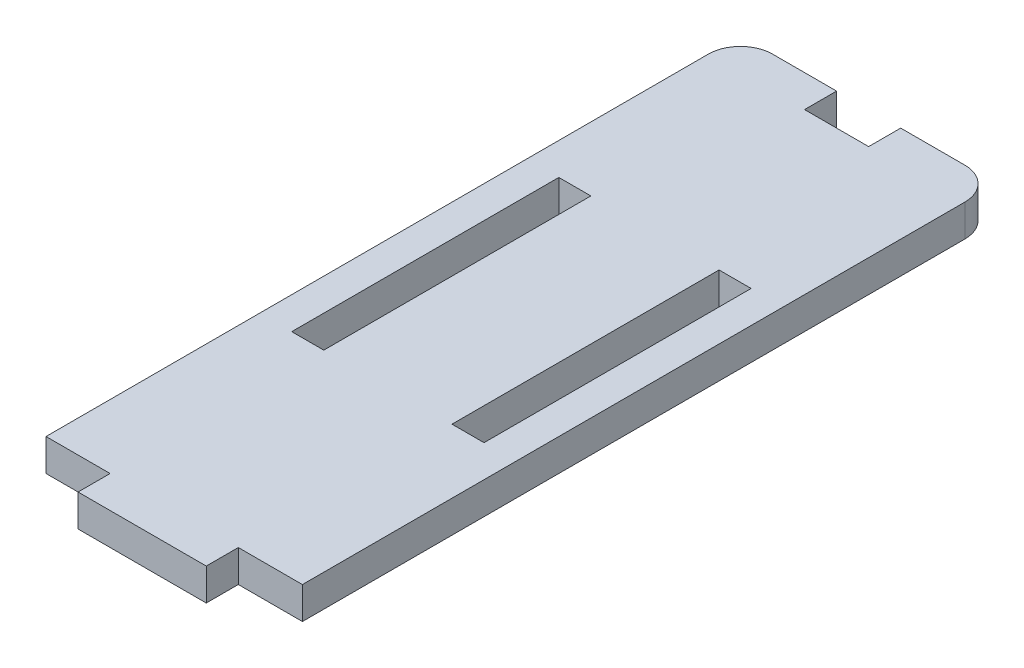
ISO-10303-21;
HEADER;
FILE_DESCRIPTION(('STEP AP214'),'2;1');
FILE_NAME('part.step','',(''),(''),'','','');
FILE_SCHEMA(('AUTOMOTIVE_DESIGN { 1 0 10303 214 1 1 1 1 }'));
ENDSEC;
DATA;
#1=APPLICATION_CONTEXT('core data for automotive mechanical design processes');
#2=APPLICATION_PROTOCOL_DEFINITION('international standard','automotive_design',2000,#1);
#3=PRODUCT_CONTEXT('',#1,'mechanical');
#4=PRODUCT('Part','Part','',(#3));
#5=PRODUCT_RELATED_PRODUCT_CATEGORY('part','',(#4));
#6=PRODUCT_DEFINITION_FORMATION('','',#4);
#7=PRODUCT_DEFINITION_CONTEXT('part definition',#1,'design');
#8=PRODUCT_DEFINITION('design','',#6,#7);
#9=PRODUCT_DEFINITION_SHAPE('','',#8);
#10=(LENGTH_UNIT() NAMED_UNIT(*) SI_UNIT(.MILLI.,.METRE.));
#11=(NAMED_UNIT(*) PLANE_ANGLE_UNIT() SI_UNIT($,.RADIAN.));
#12=(NAMED_UNIT(*) SI_UNIT($,.STERADIAN.) SOLID_ANGLE_UNIT());
#13=UNCERTAINTY_MEASURE_WITH_UNIT(LENGTH_MEASURE(1.E-05),#10,'distance_accuracy_value','');
#14=(GEOMETRIC_REPRESENTATION_CONTEXT(3) GLOBAL_UNCERTAINTY_ASSIGNED_CONTEXT((#13)) GLOBAL_UNIT_ASSIGNED_CONTEXT((#10,
#11,#12)) REPRESENTATION_CONTEXT('',''));
#15=CARTESIAN_POINT('',(0.,0.,0.));
#16=DIRECTION('',(0.,0.,1.));
#17=DIRECTION('',(1.,0.,0.));
#18=AXIS2_PLACEMENT_3D('',#15,#16,#17);
#19=CARTESIAN_POINT('',(-12.,1.5,-32.5));
#20=DIRECTION('',(0.,0.,1.));
#21=DIRECTION('',(1.,0.,0.));
#22=AXIS2_PLACEMENT_3D('',#19,#20,#21);
#23=PLANE('',#22);
#24=DIRECTION('',(-1.,0.,0.));
#25=VECTOR('',#24,1.);
#26=CARTESIAN_POINT('',(-12.,1.5,-32.5));
#27=LINE('',#26,#25);
#28=CARTESIAN_POINT('',(-3.,1.5,-32.5));
#29=VERTEX_POINT('',#28);
#30=CARTESIAN_POINT('',(-9.,1.5,-32.5));
#31=VERTEX_POINT('',#30);
#32=EDGE_CURVE('E321',#29,#31,#27,.T.);
#33=ORIENTED_EDGE('',*,*,#32,.F.);
#34=DIRECTION('',(0.,1.,0.));
#35=VECTOR('',#34,1.);
#36=CARTESIAN_POINT('',(-3.,-1.5,-32.5));
#37=LINE('',#36,#35);
#38=CARTESIAN_POINT('',(-3.,-1.5,-32.5));
#39=VERTEX_POINT('',#38);
#40=EDGE_CURVE('E202',#39,#29,#37,.T.);
#41=ORIENTED_EDGE('',*,*,#40,.F.);
#42=DIRECTION('',(-1.,0.,0.));
#43=VECTOR('',#42,1.);
#44=CARTESIAN_POINT('',(-12.,-1.5,-32.5));
#45=LINE('',#44,#43);
#46=CARTESIAN_POINT('',(-9.,-1.5,-32.5));
#47=VERTEX_POINT('',#46);
#48=EDGE_CURVE('E333',#39,#47,#45,.T.);
#49=ORIENTED_EDGE('',*,*,#48,.T.);
#50=DIRECTION('',(0.,-1.,0.));
#51=VECTOR('',#50,1.);
#52=CARTESIAN_POINT('',(-9.,1.5,-32.5));
#53=LINE('',#52,#51);
#54=EDGE_CURVE('E341',#47,#31,#53,.F.);
#55=ORIENTED_EDGE('',*,*,#54,.T.);
#56=EDGE_LOOP('',(#33,#41,#49,#55));
#57=FACE_BOUND('',#56,.T.);
#58=ADVANCED_FACE('F37',(#57),#23,.F.);
#59=CARTESIAN_POINT('',(-12.,1.5,32.5));
#60=DIRECTION('',(0.,0.,-1.));
#61=DIRECTION('',(-1.,0.,0.));
#62=AXIS2_PLACEMENT_3D('',#59,#60,#61);
#63=PLANE('',#62);
#64=DIRECTION('',(0.,-1.,0.));
#65=VECTOR('',#64,1.);
#66=CARTESIAN_POINT('',(-6.00000000000003,1.5,32.5));
#67=LINE('',#66,#65);
#68=CARTESIAN_POINT('',(-6.00000000000003,1.5,32.5));
#69=VERTEX_POINT('',#68);
#70=CARTESIAN_POINT('',(-6.00000000000003,-1.5,32.5));
#71=VERTEX_POINT('',#70);
#72=EDGE_CURVE('E294',#69,#71,#67,.T.);
#73=ORIENTED_EDGE('',*,*,#72,.F.);
#74=DIRECTION('',(1.,0.,0.));
#75=VECTOR('',#74,1.);
#76=CARTESIAN_POINT('',(-12.,1.5,32.5));
#77=LINE('',#76,#75);
#78=CARTESIAN_POINT('',(-12.,1.5,32.5));
#79=VERTEX_POINT('',#78);
#80=EDGE_CURVE('E315',#79,#69,#77,.T.);
#81=ORIENTED_EDGE('',*,*,#80,.F.);
#82=DIRECTION('',(0.,-1.,0.));
#83=VECTOR('',#82,1.);
#84=CARTESIAN_POINT('',(-12.,1.5,32.5));
#85=LINE('',#84,#83);
#86=CARTESIAN_POINT('',(-12.,-1.5,32.5));
#87=VERTEX_POINT('',#86);
#88=EDGE_CURVE('E338',#79,#87,#85,.T.);
#89=ORIENTED_EDGE('',*,*,#88,.T.);
#90=DIRECTION('',(1.,0.,0.));
#91=VECTOR('',#90,1.);
#92=CARTESIAN_POINT('',(-12.,-1.5,32.5));
#93=LINE('',#92,#91);
#94=EDGE_CURVE('E327',#87,#71,#93,.T.);
#95=ORIENTED_EDGE('',*,*,#94,.T.);
#96=EDGE_LOOP('',(#73,#81,#89,#95));
#97=FACE_BOUND('',#96,.T.);
#98=ADVANCED_FACE('F392',(#97),#63,.F.);
#99=CARTESIAN_POINT('',(-12.,1.5,-32.5));
#100=DIRECTION('',(1.,0.,0.));
#101=DIRECTION('',(0.,0.,-1.));
#102=AXIS2_PLACEMENT_3D('',#99,#100,#101);
#103=PLANE('',#102);
#104=DIRECTION('',(0.,0.,1.));
#105=VECTOR('',#104,1.);
#106=CARTESIAN_POINT('',(-12.,1.5,-32.5));
#107=LINE('',#106,#105);
#108=CARTESIAN_POINT('',(-12.,1.5,-29.5));
#109=VERTEX_POINT('',#108);
#110=EDGE_CURVE('E311',#109,#79,#107,.T.);
#111=ORIENTED_EDGE('',*,*,#110,.F.);
#112=DIRECTION('',(0.,-1.,0.));
#113=VECTOR('',#112,1.);
#114=CARTESIAN_POINT('',(-12.,1.5,-29.5));
#115=LINE('',#114,#113);
#116=CARTESIAN_POINT('',(-12.,-1.5,-29.5));
#117=VERTEX_POINT('',#116);
#118=EDGE_CURVE('E11',#109,#117,#115,.T.);
#119=ORIENTED_EDGE('',*,*,#118,.T.);
#120=DIRECTION('',(0.,0.,1.));
#121=VECTOR('',#120,1.);
#122=CARTESIAN_POINT('',(-12.,-1.5,-32.5));
#123=LINE('',#122,#121);
#124=EDGE_CURVE('E310',#117,#87,#123,.T.);
#125=ORIENTED_EDGE('',*,*,#124,.T.);
#126=ORIENTED_EDGE('',*,*,#88,.F.);
#127=EDGE_LOOP('',(#111,#119,#125,#126));
#128=FACE_BOUND('',#127,.T.);
#129=ADVANCED_FACE('F396',(#128),#103,.F.);
#130=CARTESIAN_POINT('',(6.00000000000003,1.5,32.5));
#131=VERTEX_POINT('',#130);
#132=CARTESIAN_POINT('',(12.,1.5,32.5));
#133=VERTEX_POINT('',#132);
#134=EDGE_CURVE('E313',#131,#133,#77,.T.);
#135=ORIENTED_EDGE('',*,*,#134,.F.);
#136=DIRECTION('',(0.,-1.,0.));
#137=VECTOR('',#136,1.);
#138=CARTESIAN_POINT('',(6.00000000000003,1.5,32.5));
#139=LINE('',#138,#137);
#140=CARTESIAN_POINT('',(6.00000000000003,-1.5,32.5));
#141=VERTEX_POINT('',#140);
#142=EDGE_CURVE('E301',#131,#141,#139,.T.);
#143=ORIENTED_EDGE('',*,*,#142,.T.);
#144=CARTESIAN_POINT('',(12.,-1.5,32.5));
#145=VERTEX_POINT('',#144);
#146=EDGE_CURVE('E326',#141,#145,#93,.T.);
#147=ORIENTED_EDGE('',*,*,#146,.T.);
#148=DIRECTION('',(0.,-1.,0.));
#149=VECTOR('',#148,1.);
#150=CARTESIAN_POINT('',(12.,1.5,32.5));
#151=LINE('',#150,#149);
#152=EDGE_CURVE('E324',#133,#145,#151,.T.);
#153=ORIENTED_EDGE('',*,*,#152,.F.);
#154=EDGE_LOOP('',(#135,#143,#147,#153));
#155=FACE_BOUND('',#154,.T.);
#156=ADVANCED_FACE('F375',(#155),#63,.F.);
#157=CARTESIAN_POINT('',(12.,1.5,-32.5));
#158=DIRECTION('',(-1.,0.,0.));
#159=DIRECTION('',(0.,0.,1.));
#160=AXIS2_PLACEMENT_3D('',#157,#158,#159);
#161=PLANE('',#160);
#162=DIRECTION('',(0.,0.,-1.));
#163=VECTOR('',#162,1.);
#164=CARTESIAN_POINT('',(12.,-1.5,-32.5));
#165=LINE('',#164,#163);
#166=CARTESIAN_POINT('',(12.,-1.5,-29.5));
#167=VERTEX_POINT('',#166);
#168=EDGE_CURVE('E330',#145,#167,#165,.T.);
#169=ORIENTED_EDGE('',*,*,#168,.T.);
#170=DIRECTION('',(0.,-1.,0.));
#171=VECTOR('',#170,1.);
#172=CARTESIAN_POINT('',(12.,1.5,-29.5));
#173=LINE('',#172,#171);
#174=CARTESIAN_POINT('',(12.,1.5,-29.5));
#175=VERTEX_POINT('',#174);
#176=EDGE_CURVE('E352',#167,#175,#173,.F.);
#177=ORIENTED_EDGE('',*,*,#176,.T.);
#178=DIRECTION('',(0.,0.,-1.));
#179=VECTOR('',#178,1.);
#180=CARTESIAN_POINT('',(12.,1.5,-32.5));
#181=LINE('',#180,#179);
#182=EDGE_CURVE('E318',#133,#175,#181,.T.);
#183=ORIENTED_EDGE('',*,*,#182,.F.);
#184=ORIENTED_EDGE('',*,*,#152,.T.);
#185=EDGE_LOOP('',(#169,#177,#183,#184));
#186=FACE_BOUND('',#185,.T.);
#187=ADVANCED_FACE('F371',(#186),#161,.F.);
#188=CARTESIAN_POINT('',(9.,-1.5,-32.5));
#189=VERTEX_POINT('',#188);
#190=CARTESIAN_POINT('',(3.,-1.5,-32.5));
#191=VERTEX_POINT('',#190);
#192=EDGE_CURVE('E314',#189,#191,#45,.T.);
#193=ORIENTED_EDGE('',*,*,#192,.T.);
#194=DIRECTION('',(0.,1.,0.));
#195=VECTOR('',#194,1.);
#196=CARTESIAN_POINT('',(3.,-1.5,-32.5));
#197=LINE('',#196,#195);
#198=CARTESIAN_POINT('',(3.,1.5,-32.5));
#199=VERTEX_POINT('',#198);
#200=EDGE_CURVE('E218',#191,#199,#197,.T.);
#201=ORIENTED_EDGE('',*,*,#200,.T.);
#202=CARTESIAN_POINT('',(9.,1.5,-32.5));
#203=VERTEX_POINT('',#202);
#204=EDGE_CURVE('E322',#203,#199,#27,.T.);
#205=ORIENTED_EDGE('',*,*,#204,.F.);
#206=DIRECTION('',(0.,-1.,0.));
#207=VECTOR('',#206,1.);
#208=CARTESIAN_POINT('',(9.,1.5,-32.5));
#209=LINE('',#208,#207);
#210=EDGE_CURVE('E344',#203,#189,#209,.T.);
#211=ORIENTED_EDGE('',*,*,#210,.T.);
#212=EDGE_LOOP('',(#193,#201,#205,#211));
#213=FACE_BOUND('',#212,.T.);
#214=ADVANCED_FACE('F361',(#213),#23,.F.);
#215=CARTESIAN_POINT('',(0.,1.5,0.));
#216=DIRECTION('',(0.,1.,0.));
#217=DIRECTION('',(0.,0.,1.));
#218=AXIS2_PLACEMENT_3D('',#215,#216,#217);
#219=PLANE('',#218);
#220=DIRECTION('',(0.,0.,1.));
#221=VECTOR('',#220,1.);
#222=CARTESIAN_POINT('',(-3.,1.5,-32.5));
#223=LINE('',#222,#221);
#224=CARTESIAN_POINT('',(-3.,1.5,-29.5));
#225=VERTEX_POINT('',#224);
#226=EDGE_CURVE('E199',#29,#225,#223,.T.);
#227=ORIENTED_EDGE('',*,*,#226,.F.);
#228=ORIENTED_EDGE('',*,*,#32,.T.);
#229=CARTESIAN_POINT('',(-9.,1.5,-29.5));
#230=DIRECTION('',(0.,1.,0.));
#231=DIRECTION('',(0.,0.,1.));
#232=AXIS2_PLACEMENT_3D('',#229,#230,#231);
#233=CIRCLE('',#232,3.);
#234=EDGE_CURVE('E60',#31,#109,#233,.T.);
#235=ORIENTED_EDGE('',*,*,#234,.T.);
#236=ORIENTED_EDGE('',*,*,#110,.T.);
#237=ORIENTED_EDGE('',*,*,#80,.T.);
#238=DIRECTION('',(0.,0.,1.));
#239=VECTOR('',#238,1.);
#240=CARTESIAN_POINT('',(-6.00000000000003,1.5,32.5));
#241=LINE('',#240,#239);
#242=CARTESIAN_POINT('',(-6.00000000000003,1.5,35.5));
#243=VERTEX_POINT('',#242);
#244=EDGE_CURVE('E286',#69,#243,#241,.T.);
#245=ORIENTED_EDGE('',*,*,#244,.T.);
#246=DIRECTION('',(1.,0.,0.));
#247=VECTOR('',#246,1.);
#248=CARTESIAN_POINT('',(-6.00000000000003,1.5,35.5));
#249=LINE('',#248,#247);
#250=CARTESIAN_POINT('',(5.99999999999997,1.5,35.5));
#251=VERTEX_POINT('',#250);
#252=EDGE_CURVE('E289',#243,#251,#249,.T.);
#253=ORIENTED_EDGE('',*,*,#252,.T.);
#254=DIRECTION('',(0.,0.,-1.));
#255=VECTOR('',#254,1.);
#256=CARTESIAN_POINT('',(6.00000000000003,1.5,32.5));
#257=LINE('',#256,#255);
#258=EDGE_CURVE('E292',#251,#131,#257,.T.);
#259=ORIENTED_EDGE('',*,*,#258,.T.);
#260=ORIENTED_EDGE('',*,*,#134,.T.);
#261=ORIENTED_EDGE('',*,*,#182,.T.);
#262=CARTESIAN_POINT('',(9.,1.5,-29.5));
#263=DIRECTION('',(0.,1.,0.));
#264=DIRECTION('',(0.,0.,1.));
#265=AXIS2_PLACEMENT_3D('',#262,#263,#264);
#266=CIRCLE('',#265,3.);
#267=EDGE_CURVE('E45',#175,#203,#266,.T.);
#268=ORIENTED_EDGE('',*,*,#267,.T.);
#269=ORIENTED_EDGE('',*,*,#204,.T.);
#270=DIRECTION('',(0.,0.,-1.));
#271=VECTOR('',#270,1.);
#272=CARTESIAN_POINT('',(3.,1.5,-32.5));
#273=LINE('',#272,#271);
#274=CARTESIAN_POINT('',(3.,1.5,-29.5));
#275=VERTEX_POINT('',#274);
#276=EDGE_CURVE('E208',#275,#199,#273,.T.);
#277=ORIENTED_EDGE('',*,*,#276,.F.);
#278=DIRECTION('',(1.,0.,0.));
#279=VECTOR('',#278,1.);
#280=CARTESIAN_POINT('',(-3.,1.5,-29.5));
#281=LINE('',#280,#279);
#282=EDGE_CURVE('E190',#225,#275,#281,.T.);
#283=ORIENTED_EDGE('',*,*,#282,.F.);
#284=EDGE_LOOP('',(#227,#228,#235,#236,#237,#245,#253,#259,#260,#261,#268,#269,#277,#283));
#285=FACE_BOUND('',#284,.T.);
#286=DIRECTION('',(0.,0.,1.));
#287=VECTOR('',#286,1.);
#288=CARTESIAN_POINT('',(-8.99999999999999,1.5,-12.5));
#289=LINE('',#288,#287);
#290=CARTESIAN_POINT('',(-8.99999999999999,1.5,-12.5));
#291=VERTEX_POINT('',#290);
#292=CARTESIAN_POINT('',(-8.99999999999999,1.5,12.5));
#293=VERTEX_POINT('',#292);
#294=EDGE_CURVE('E222',#291,#293,#289,.T.);
#295=ORIENTED_EDGE('',*,*,#294,.F.);
#296=DIRECTION('',(-1.,0.,0.));
#297=VECTOR('',#296,1.);
#298=CARTESIAN_POINT('',(-8.99999999999999,1.5,-12.5));
#299=LINE('',#298,#297);
#300=CARTESIAN_POINT('',(-5.99999999999999,1.5,-12.5));
#301=VERTEX_POINT('',#300);
#302=EDGE_CURVE('E231',#301,#291,#299,.T.);
#303=ORIENTED_EDGE('',*,*,#302,.F.);
#304=DIRECTION('',(0.,0.,-1.));
#305=VECTOR('',#304,1.);
#306=CARTESIAN_POINT('',(-5.99999999999999,1.5,-12.5));
#307=LINE('',#306,#305);
#308=CARTESIAN_POINT('',(-5.99999999999999,1.5,12.5));
#309=VERTEX_POINT('',#308);
#310=EDGE_CURVE('E228',#309,#301,#307,.T.);
#311=ORIENTED_EDGE('',*,*,#310,.F.);
#312=DIRECTION('',(1.,0.,0.));
#313=VECTOR('',#312,1.);
#314=CARTESIAN_POINT('',(-8.99999999999999,1.5,12.5));
#315=LINE('',#314,#313);
#316=EDGE_CURVE('E224',#293,#309,#315,.T.);
#317=ORIENTED_EDGE('',*,*,#316,.F.);
#318=EDGE_LOOP('',(#295,#303,#311,#317));
#319=FACE_BOUND('',#318,.T.);
#320=DIRECTION('',(-1.,0.,0.));
#321=VECTOR('',#320,1.);
#322=CARTESIAN_POINT('',(8.99999999999999,1.5,-12.5));
#323=LINE('',#322,#321);
#324=CARTESIAN_POINT('',(8.99999999999999,1.5,-12.5));
#325=VERTEX_POINT('',#324);
#326=CARTESIAN_POINT('',(5.99999999999999,1.5,-12.5));
#327=VERTEX_POINT('',#326);
#328=EDGE_CURVE('E217',#325,#327,#323,.T.);
#329=ORIENTED_EDGE('',*,*,#328,.F.);
#330=DIRECTION('',(0.,0.,-1.));
#331=VECTOR('',#330,1.);
#332=CARTESIAN_POINT('',(8.99999999999999,1.5,-12.5));
#333=LINE('',#332,#331);
#334=CARTESIAN_POINT('',(8.99999999999999,1.5,12.5));
#335=VERTEX_POINT('',#334);
#336=EDGE_CURVE('E263',#335,#325,#333,.T.);
#337=ORIENTED_EDGE('',*,*,#336,.F.);
#338=DIRECTION('',(1.,0.,0.));
#339=VECTOR('',#338,1.);
#340=CARTESIAN_POINT('',(8.99999999999999,1.5,12.5));
#341=LINE('',#340,#339);
#342=CARTESIAN_POINT('',(5.99999999999999,1.5,12.5));
#343=VERTEX_POINT('',#342);
#344=EDGE_CURVE('E260',#343,#335,#341,.T.);
#345=ORIENTED_EDGE('',*,*,#344,.F.);
#346=DIRECTION('',(0.,0.,1.));
#347=VECTOR('',#346,1.);
#348=CARTESIAN_POINT('',(5.99999999999999,1.5,-12.5));
#349=LINE('',#348,#347);
#350=EDGE_CURVE('E257',#327,#343,#349,.T.);
#351=ORIENTED_EDGE('',*,*,#350,.F.);
#352=EDGE_LOOP('',(#329,#337,#345,#351));
#353=FACE_BOUND('',#352,.T.);
#354=ADVANCED_FACE('F205',(#285,#319,#353),#219,.T.);
#355=CARTESIAN_POINT('',(0.,-1.5,0.));
#356=DIRECTION('',(0.,1.,0.));
#357=DIRECTION('',(0.,0.,1.));
#358=AXIS2_PLACEMENT_3D('',#355,#356,#357);
#359=PLANE('',#358);
#360=ORIENTED_EDGE('',*,*,#48,.F.);
#361=DIRECTION('',(0.,0.,1.));
#362=VECTOR('',#361,1.);
#363=CARTESIAN_POINT('',(-3.,-1.5,-32.5));
#364=LINE('',#363,#362);
#365=CARTESIAN_POINT('',(-3.,-1.5,-29.5));
#366=VERTEX_POINT('',#365);
#367=EDGE_CURVE('E210',#39,#366,#364,.T.);
#368=ORIENTED_EDGE('',*,*,#367,.T.);
#369=DIRECTION('',(1.,0.,0.));
#370=VECTOR('',#369,1.);
#371=CARTESIAN_POINT('',(-3.,-1.5,-29.5));
#372=LINE('',#371,#370);
#373=CARTESIAN_POINT('',(3.,-1.5,-29.5));
#374=VERTEX_POINT('',#373);
#375=EDGE_CURVE('E193',#366,#374,#372,.T.);
#376=ORIENTED_EDGE('',*,*,#375,.T.);
#377=DIRECTION('',(0.,0.,-1.));
#378=VECTOR('',#377,1.);
#379=CARTESIAN_POINT('',(3.,-1.5,-32.5));
#380=LINE('',#379,#378);
#381=EDGE_CURVE('E52',#374,#191,#380,.T.);
#382=ORIENTED_EDGE('',*,*,#381,.T.);
#383=ORIENTED_EDGE('',*,*,#192,.F.);
#384=CARTESIAN_POINT('',(9.,-1.5,-29.5));
#385=DIRECTION('',(0.,1.,0.));
#386=DIRECTION('',(0.,0.,1.));
#387=AXIS2_PLACEMENT_3D('',#384,#385,#386);
#388=CIRCLE('',#387,3.);
#389=EDGE_CURVE('E350',#189,#167,#388,.F.);
#390=ORIENTED_EDGE('',*,*,#389,.T.);
#391=ORIENTED_EDGE('',*,*,#168,.F.);
#392=ORIENTED_EDGE('',*,*,#146,.F.);
#393=DIRECTION('',(0.,0.,-1.));
#394=VECTOR('',#393,1.);
#395=CARTESIAN_POINT('',(6.00000000000003,-1.5,32.5));
#396=LINE('',#395,#394);
#397=CARTESIAN_POINT('',(5.99999999999997,-1.5,35.5));
#398=VERTEX_POINT('',#397);
#399=EDGE_CURVE('E290',#398,#141,#396,.T.);
#400=ORIENTED_EDGE('',*,*,#399,.F.);
#401=DIRECTION('',(1.,0.,0.));
#402=VECTOR('',#401,1.);
#403=CARTESIAN_POINT('',(-6.00000000000003,-1.5,35.5));
#404=LINE('',#403,#402);
#405=CARTESIAN_POINT('',(-6.00000000000003,-1.5,35.5));
#406=VERTEX_POINT('',#405);
#407=EDGE_CURVE('E297',#406,#398,#404,.T.);
#408=ORIENTED_EDGE('',*,*,#407,.F.);
#409=DIRECTION('',(0.,0.,1.));
#410=VECTOR('',#409,1.);
#411=CARTESIAN_POINT('',(-6.00000000000003,-1.5,32.5));
#412=LINE('',#411,#410);
#413=EDGE_CURVE('E249',#71,#406,#412,.T.);
#414=ORIENTED_EDGE('',*,*,#413,.F.);
#415=ORIENTED_EDGE('',*,*,#94,.F.);
#416=ORIENTED_EDGE('',*,*,#124,.F.);
#417=CARTESIAN_POINT('',(-9.,-1.5,-29.5));
#418=DIRECTION('',(0.,1.,0.));
#419=DIRECTION('',(0.,0.,1.));
#420=AXIS2_PLACEMENT_3D('',#417,#418,#419);
#421=CIRCLE('',#420,3.);
#422=EDGE_CURVE('E347',#117,#47,#421,.F.);
#423=ORIENTED_EDGE('',*,*,#422,.T.);
#424=EDGE_LOOP('',(#360,#368,#376,#382,#383,#390,#391,#392,#400,#408,#414,#415,#416,#423));
#425=FACE_BOUND('',#424,.T.);
#426=DIRECTION('',(-1.,0.,0.));
#427=VECTOR('',#426,1.);
#428=CARTESIAN_POINT('',(-8.99999999999999,-1.5,-12.5));
#429=LINE('',#428,#427);
#430=CARTESIAN_POINT('',(-5.99999999999999,-1.5,-12.5));
#431=VERTEX_POINT('',#430);
#432=CARTESIAN_POINT('',(-8.99999999999999,-1.5,-12.5));
#433=VERTEX_POINT('',#432);
#434=EDGE_CURVE('E243',#431,#433,#429,.T.);
#435=ORIENTED_EDGE('',*,*,#434,.T.);
#436=DIRECTION('',(0.,0.,1.));
#437=VECTOR('',#436,1.);
#438=CARTESIAN_POINT('',(-8.99999999999999,-1.5,-12.5));
#439=LINE('',#438,#437);
#440=CARTESIAN_POINT('',(-8.99999999999999,-1.5,12.5));
#441=VERTEX_POINT('',#440);
#442=EDGE_CURVE('E234',#433,#441,#439,.T.);
#443=ORIENTED_EDGE('',*,*,#442,.T.);
#444=DIRECTION('',(1.,0.,0.));
#445=VECTOR('',#444,1.);
#446=CARTESIAN_POINT('',(-8.99999999999999,-1.5,12.5));
#447=LINE('',#446,#445);
#448=CARTESIAN_POINT('',(-5.99999999999999,-1.5,12.5));
#449=VERTEX_POINT('',#448);
#450=EDGE_CURVE('E237',#441,#449,#447,.T.);
#451=ORIENTED_EDGE('',*,*,#450,.T.);
#452=DIRECTION('',(0.,0.,-1.));
#453=VECTOR('',#452,1.);
#454=CARTESIAN_POINT('',(-5.99999999999999,-1.5,-12.5));
#455=LINE('',#454,#453);
#456=EDGE_CURVE('E240',#449,#431,#455,.T.);
#457=ORIENTED_EDGE('',*,*,#456,.T.);
#458=EDGE_LOOP('',(#435,#443,#451,#457));
#459=FACE_BOUND('',#458,.T.);
#460=DIRECTION('',(0.,0.,-1.));
#461=VECTOR('',#460,1.);
#462=CARTESIAN_POINT('',(8.99999999999999,-1.5,-12.5));
#463=LINE('',#462,#461);
#464=CARTESIAN_POINT('',(8.99999999999999,-1.5,12.5));
#465=VERTEX_POINT('',#464);
#466=CARTESIAN_POINT('',(8.99999999999999,-1.5,-12.5));
#467=VERTEX_POINT('',#466);
#468=EDGE_CURVE('E275',#465,#467,#463,.T.);
#469=ORIENTED_EDGE('',*,*,#468,.T.);
#470=DIRECTION('',(-1.,0.,0.));
#471=VECTOR('',#470,1.);
#472=CARTESIAN_POINT('',(8.99999999999999,-1.5,-12.5));
#473=LINE('',#472,#471);
#474=CARTESIAN_POINT('',(5.99999999999999,-1.5,-12.5));
#475=VERTEX_POINT('',#474);
#476=EDGE_CURVE('E266',#467,#475,#473,.T.);
#477=ORIENTED_EDGE('',*,*,#476,.T.);
#478=DIRECTION('',(0.,0.,1.));
#479=VECTOR('',#478,1.);
#480=CARTESIAN_POINT('',(5.99999999999999,-1.5,-12.5));
#481=LINE('',#480,#479);
#482=CARTESIAN_POINT('',(5.99999999999999,-1.5,12.5));
#483=VERTEX_POINT('',#482);
#484=EDGE_CURVE('E269',#475,#483,#481,.T.);
#485=ORIENTED_EDGE('',*,*,#484,.T.);
#486=DIRECTION('',(1.,0.,0.));
#487=VECTOR('',#486,1.);
#488=CARTESIAN_POINT('',(8.99999999999999,-1.5,12.5));
#489=LINE('',#488,#487);
#490=EDGE_CURVE('E272',#483,#465,#489,.T.);
#491=ORIENTED_EDGE('',*,*,#490,.T.);
#492=EDGE_LOOP('',(#469,#477,#485,#491));
#493=FACE_BOUND('',#492,.T.);
#494=ADVANCED_FACE('F367',(#425,#459,#493),#359,.F.);
#495=CARTESIAN_POINT('',(-6.00000000000003,1.5,32.5));
#496=DIRECTION('',(1.,0.,0.));
#497=DIRECTION('',(0.,0.,-1.));
#498=AXIS2_PLACEMENT_3D('',#495,#496,#497);
#499=PLANE('',#498);
#500=ORIENTED_EDGE('',*,*,#413,.T.);
#501=DIRECTION('',(0.,-1.,0.));
#502=VECTOR('',#501,1.);
#503=CARTESIAN_POINT('',(-6.00000000000003,1.5,35.5));
#504=LINE('',#503,#502);
#505=EDGE_CURVE('E307',#243,#406,#504,.T.);
#506=ORIENTED_EDGE('',*,*,#505,.F.);
#507=ORIENTED_EDGE('',*,*,#244,.F.);
#508=ORIENTED_EDGE('',*,*,#72,.T.);
#509=EDGE_LOOP('',(#500,#506,#507,#508));
#510=FACE_BOUND('',#509,.T.);
#511=ADVANCED_FACE('F387',(#510),#499,.F.);
#512=CARTESIAN_POINT('',(-6.00000000000003,1.5,35.5));
#513=DIRECTION('',(0.,0.,-1.));
#514=DIRECTION('',(-1.,0.,0.));
#515=AXIS2_PLACEMENT_3D('',#512,#513,#514);
#516=PLANE('',#515);
#517=ORIENTED_EDGE('',*,*,#407,.T.);
#518=DIRECTION('',(0.,-1.,0.));
#519=VECTOR('',#518,1.);
#520=CARTESIAN_POINT('',(5.99999999999997,1.5,35.5));
#521=LINE('',#520,#519);
#522=EDGE_CURVE('E304',#251,#398,#521,.T.);
#523=ORIENTED_EDGE('',*,*,#522,.F.);
#524=ORIENTED_EDGE('',*,*,#252,.F.);
#525=ORIENTED_EDGE('',*,*,#505,.T.);
#526=EDGE_LOOP('',(#517,#523,#524,#525));
#527=FACE_BOUND('',#526,.T.);
#528=ADVANCED_FACE('F384',(#527),#516,.F.);
#529=CARTESIAN_POINT('',(6.00000000000003,1.5,32.5));
#530=DIRECTION('',(-1.,0.,0.));
#531=DIRECTION('',(0.,0.,1.));
#532=AXIS2_PLACEMENT_3D('',#529,#530,#531);
#533=PLANE('',#532);
#534=ORIENTED_EDGE('',*,*,#399,.T.);
#535=ORIENTED_EDGE('',*,*,#142,.F.);
#536=ORIENTED_EDGE('',*,*,#258,.F.);
#537=ORIENTED_EDGE('',*,*,#522,.T.);
#538=EDGE_LOOP('',(#534,#535,#536,#537));
#539=FACE_BOUND('',#538,.T.);
#540=ADVANCED_FACE('F380',(#539),#533,.F.);
#541=CARTESIAN_POINT('',(8.99999999999999,-1.5,-12.5));
#542=DIRECTION('',(0.,0.,-1.));
#543=DIRECTION('',(-1.,0.,0.));
#544=AXIS2_PLACEMENT_3D('',#541,#542,#543);
#545=PLANE('',#544);
#546=DIRECTION('',(0.,1.,0.));
#547=VECTOR('',#546,1.);
#548=CARTESIAN_POINT('',(5.99999999999999,-1.5,-12.5));
#549=LINE('',#548,#547);
#550=EDGE_CURVE('E278',#475,#327,#549,.T.);
#551=ORIENTED_EDGE('',*,*,#550,.F.);
#552=ORIENTED_EDGE('',*,*,#476,.F.);
#553=DIRECTION('',(0.,1.,0.));
#554=VECTOR('',#553,1.);
#555=CARTESIAN_POINT('',(8.99999999999999,-1.5,-12.5));
#556=LINE('',#555,#554);
#557=EDGE_CURVE('E225',#467,#325,#556,.T.);
#558=ORIENTED_EDGE('',*,*,#557,.T.);
#559=ORIENTED_EDGE('',*,*,#328,.T.);
#560=EDGE_LOOP('',(#551,#552,#558,#559));
#561=FACE_BOUND('',#560,.T.);
#562=ADVANCED_FACE('F447',(#561),#545,.F.);
#563=CARTESIAN_POINT('',(8.99999999999999,-1.5,-12.5));
#564=DIRECTION('',(1.,0.,0.));
#565=DIRECTION('',(0.,0.,-1.));
#566=AXIS2_PLACEMENT_3D('',#563,#564,#565);
#567=PLANE('',#566);
#568=ORIENTED_EDGE('',*,*,#557,.F.);
#569=ORIENTED_EDGE('',*,*,#468,.F.);
#570=DIRECTION('',(0.,1.,0.));
#571=VECTOR('',#570,1.);
#572=CARTESIAN_POINT('',(8.99999999999999,-1.5,12.5));
#573=LINE('',#572,#571);
#574=EDGE_CURVE('E280',#465,#335,#573,.T.);
#575=ORIENTED_EDGE('',*,*,#574,.T.);
#576=ORIENTED_EDGE('',*,*,#336,.T.);
#577=EDGE_LOOP('',(#568,#569,#575,#576));
#578=FACE_BOUND('',#577,.T.);
#579=ADVANCED_FACE('F443',(#578),#567,.F.);
#580=CARTESIAN_POINT('',(8.99999999999999,-1.5,12.5));
#581=DIRECTION('',(0.,0.,1.));
#582=DIRECTION('',(1.,0.,0.));
#583=AXIS2_PLACEMENT_3D('',#580,#581,#582);
#584=PLANE('',#583);
#585=ORIENTED_EDGE('',*,*,#574,.F.);
#586=ORIENTED_EDGE('',*,*,#490,.F.);
#587=DIRECTION('',(0.,1.,0.));
#588=VECTOR('',#587,1.);
#589=CARTESIAN_POINT('',(5.99999999999999,-1.5,12.5));
#590=LINE('',#589,#588);
#591=EDGE_CURVE('E282',#483,#343,#590,.T.);
#592=ORIENTED_EDGE('',*,*,#591,.T.);
#593=ORIENTED_EDGE('',*,*,#344,.T.);
#594=EDGE_LOOP('',(#585,#586,#592,#593));
#595=FACE_BOUND('',#594,.T.);
#596=ADVANCED_FACE('F446',(#595),#584,.F.);
#597=CARTESIAN_POINT('',(5.99999999999999,-1.5,-12.5));
#598=DIRECTION('',(-1.,0.,0.));
#599=DIRECTION('',(0.,0.,1.));
#600=AXIS2_PLACEMENT_3D('',#597,#598,#599);
#601=PLANE('',#600);
#602=ORIENTED_EDGE('',*,*,#591,.F.);
#603=ORIENTED_EDGE('',*,*,#484,.F.);
#604=ORIENTED_EDGE('',*,*,#550,.T.);
#605=ORIENTED_EDGE('',*,*,#350,.T.);
#606=EDGE_LOOP('',(#602,#603,#604,#605));
#607=FACE_BOUND('',#606,.T.);
#608=ADVANCED_FACE('F441',(#607),#601,.F.);
#609=CARTESIAN_POINT('',(-8.99999999999999,-1.5,-12.5));
#610=DIRECTION('',(-1.,0.,0.));
#611=DIRECTION('',(0.,0.,1.));
#612=AXIS2_PLACEMENT_3D('',#609,#610,#611);
#613=PLANE('',#612);
#614=DIRECTION('',(0.,1.,0.));
#615=VECTOR('',#614,1.);
#616=CARTESIAN_POINT('',(-8.99999999999999,-1.5,12.5));
#617=LINE('',#616,#615);
#618=EDGE_CURVE('E246',#441,#293,#617,.T.);
#619=ORIENTED_EDGE('',*,*,#618,.F.);
#620=ORIENTED_EDGE('',*,*,#442,.F.);
#621=DIRECTION('',(0.,1.,0.));
#622=VECTOR('',#621,1.);
#623=CARTESIAN_POINT('',(-8.99999999999999,-1.5,-12.5));
#624=LINE('',#623,#622);
#625=EDGE_CURVE('E247',#433,#291,#624,.T.);
#626=ORIENTED_EDGE('',*,*,#625,.T.);
#627=ORIENTED_EDGE('',*,*,#294,.T.);
#628=EDGE_LOOP('',(#619,#620,#626,#627));
#629=FACE_BOUND('',#628,.T.);
#630=ADVANCED_FACE('F438',(#629),#613,.F.);
#631=CARTESIAN_POINT('',(-8.99999999999999,-1.5,-12.5));
#632=DIRECTION('',(0.,0.,-1.));
#633=DIRECTION('',(-1.,0.,0.));
#634=AXIS2_PLACEMENT_3D('',#631,#632,#633);
#635=PLANE('',#634);
#636=ORIENTED_EDGE('',*,*,#625,.F.);
#637=ORIENTED_EDGE('',*,*,#434,.F.);
#638=DIRECTION('',(0.,1.,0.));
#639=VECTOR('',#638,1.);
#640=CARTESIAN_POINT('',(-5.99999999999999,-1.5,-12.5));
#641=LINE('',#640,#639);
#642=EDGE_CURVE('E250',#431,#301,#641,.T.);
#643=ORIENTED_EDGE('',*,*,#642,.T.);
#644=ORIENTED_EDGE('',*,*,#302,.T.);
#645=EDGE_LOOP('',(#636,#637,#643,#644));
#646=FACE_BOUND('',#645,.T.);
#647=ADVANCED_FACE('F432',(#646),#635,.F.);
#648=CARTESIAN_POINT('',(-5.99999999999999,-1.5,-12.5));
#649=DIRECTION('',(1.,0.,0.));
#650=DIRECTION('',(0.,0.,-1.));
#651=AXIS2_PLACEMENT_3D('',#648,#649,#650);
#652=PLANE('',#651);
#653=ORIENTED_EDGE('',*,*,#642,.F.);
#654=ORIENTED_EDGE('',*,*,#456,.F.);
#655=DIRECTION('',(0.,1.,0.));
#656=VECTOR('',#655,1.);
#657=CARTESIAN_POINT('',(-5.99999999999999,-1.5,12.5));
#658=LINE('',#657,#656);
#659=EDGE_CURVE('E252',#449,#309,#658,.T.);
#660=ORIENTED_EDGE('',*,*,#659,.T.);
#661=ORIENTED_EDGE('',*,*,#310,.T.);
#662=EDGE_LOOP('',(#653,#654,#660,#661));
#663=FACE_BOUND('',#662,.T.);
#664=ADVANCED_FACE('F426',(#663),#652,.F.);
#665=CARTESIAN_POINT('',(-8.99999999999999,-1.5,12.5));
#666=DIRECTION('',(0.,0.,1.));
#667=DIRECTION('',(1.,0.,0.));
#668=AXIS2_PLACEMENT_3D('',#665,#666,#667);
#669=PLANE('',#668);
#670=ORIENTED_EDGE('',*,*,#659,.F.);
#671=ORIENTED_EDGE('',*,*,#450,.F.);
#672=ORIENTED_EDGE('',*,*,#618,.T.);
#673=ORIENTED_EDGE('',*,*,#316,.T.);
#674=EDGE_LOOP('',(#670,#671,#672,#673));
#675=FACE_BOUND('',#674,.T.);
#676=ADVANCED_FACE('F421',(#675),#669,.F.);
#677=CARTESIAN_POINT('',(9.,1.5,-29.5));
#678=DIRECTION('',(0.,-1.,0.));
#679=DIRECTION('',(0.,0.,-1.));
#680=AXIS2_PLACEMENT_3D('',#677,#678,#679);
#681=CYLINDRICAL_SURFACE('',#680,3.);
#682=ORIENTED_EDGE('',*,*,#267,.F.);
#683=ORIENTED_EDGE('',*,*,#176,.F.);
#684=ORIENTED_EDGE('',*,*,#389,.F.);
#685=ORIENTED_EDGE('',*,*,#210,.F.);
#686=EDGE_LOOP('',(#682,#683,#684,#685));
#687=FACE_BOUND('',#686,.T.);
#688=ADVANCED_FACE('F363',(#687),#681,.T.);
#689=CARTESIAN_POINT('',(-9.,1.5,-29.5));
#690=DIRECTION('',(0.,-1.,0.));
#691=DIRECTION('',(0.,0.,-1.));
#692=AXIS2_PLACEMENT_3D('',#689,#690,#691);
#693=CYLINDRICAL_SURFACE('',#692,3.);
#694=ORIENTED_EDGE('',*,*,#234,.F.);
#695=ORIENTED_EDGE('',*,*,#54,.F.);
#696=ORIENTED_EDGE('',*,*,#422,.F.);
#697=ORIENTED_EDGE('',*,*,#118,.F.);
#698=EDGE_LOOP('',(#694,#695,#696,#697));
#699=FACE_BOUND('',#698,.T.);
#700=ADVANCED_FACE('F39',(#699),#693,.T.);
#701=CARTESIAN_POINT('',(-3.,-1.5,-32.5));
#702=DIRECTION('',(-1.,0.,0.));
#703=DIRECTION('',(0.,0.,1.));
#704=AXIS2_PLACEMENT_3D('',#701,#702,#703);
#705=PLANE('',#704);
#706=DIRECTION('',(0.,1.,0.));
#707=VECTOR('',#706,1.);
#708=CARTESIAN_POINT('',(-3.,-1.5,-29.5));
#709=LINE('',#708,#707);
#710=EDGE_CURVE('E186',#366,#225,#709,.T.);
#711=ORIENTED_EDGE('',*,*,#710,.F.);
#712=ORIENTED_EDGE('',*,*,#367,.F.);
#713=ORIENTED_EDGE('',*,*,#40,.T.);
#714=ORIENTED_EDGE('',*,*,#226,.T.);
#715=EDGE_LOOP('',(#711,#712,#713,#714));
#716=FACE_BOUND('',#715,.T.);
#717=ADVANCED_FACE('F200',(#716),#705,.F.);
#718=CARTESIAN_POINT('',(3.,-1.5,-32.5));
#719=DIRECTION('',(1.,0.,0.));
#720=DIRECTION('',(0.,0.,-1.));
#721=AXIS2_PLACEMENT_3D('',#718,#719,#720);
#722=PLANE('',#721);
#723=ORIENTED_EDGE('',*,*,#200,.F.);
#724=ORIENTED_EDGE('',*,*,#381,.F.);
#725=DIRECTION('',(0.,1.,0.));
#726=VECTOR('',#725,1.);
#727=CARTESIAN_POINT('',(3.,-1.5,-29.5));
#728=LINE('',#727,#726);
#729=EDGE_CURVE('E196',#374,#275,#728,.T.);
#730=ORIENTED_EDGE('',*,*,#729,.T.);
#731=ORIENTED_EDGE('',*,*,#276,.T.);
#732=EDGE_LOOP('',(#723,#724,#730,#731));
#733=FACE_BOUND('',#732,.T.);
#734=ADVANCED_FACE('F594',(#733),#722,.F.);
#735=CARTESIAN_POINT('',(-3.,-1.5,-29.5));
#736=DIRECTION('',(0.,0.,1.));
#737=DIRECTION('',(1.,0.,0.));
#738=AXIS2_PLACEMENT_3D('',#735,#736,#737);
#739=PLANE('',#738);
#740=ORIENTED_EDGE('',*,*,#729,.F.);
#741=ORIENTED_EDGE('',*,*,#375,.F.);
#742=ORIENTED_EDGE('',*,*,#710,.T.);
#743=ORIENTED_EDGE('',*,*,#282,.T.);
#744=EDGE_LOOP('',(#740,#741,#742,#743));
#745=FACE_BOUND('',#744,.T.);
#746=ADVANCED_FACE('F188',(#745),#739,.F.);
#747=CLOSED_SHELL('',(#58,#98,#129,#156,#187,#214,#354,#494,#511,#528,#540,#562,#579,#596,#608,
#630,#647,#664,#676,#688,#700,#717,#734,#746));
#748=MANIFOLD_SOLID_BREP('B2',#747);
#749=ADVANCED_BREP_SHAPE_REPRESENTATION('',(#18,#748),#14);
#750=SHAPE_DEFINITION_REPRESENTATION(#9,#749);
ENDSEC;
END-ISO-10303-21;
